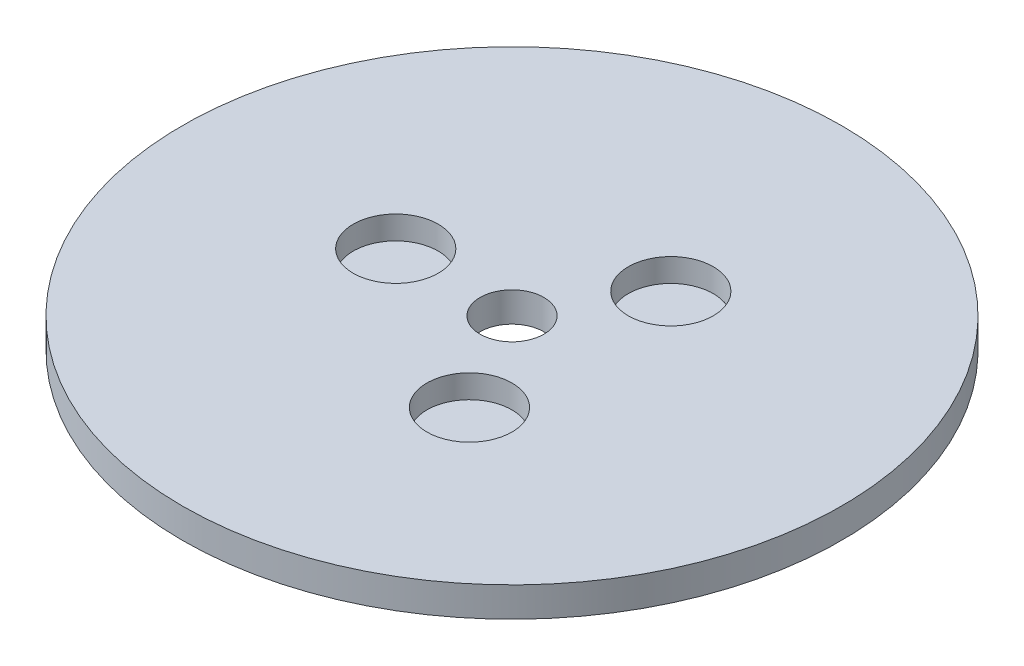
ISO-10303-21;
HEADER;
FILE_DESCRIPTION(('STEP AP214'),'2;1');
FILE_NAME('part.step','',(''),(''),'','','');
FILE_SCHEMA(('AUTOMOTIVE_DESIGN { 1 0 10303 214 1 1 1 1 }'));
ENDSEC;
DATA;
#1=APPLICATION_CONTEXT('core data for automotive mechanical design processes');
#2=APPLICATION_PROTOCOL_DEFINITION('international standard','automotive_design',2000,#1);
#3=PRODUCT_CONTEXT('',#1,'mechanical');
#4=PRODUCT('Part','Part','',(#3));
#5=PRODUCT_RELATED_PRODUCT_CATEGORY('part','',(#4));
#6=PRODUCT_DEFINITION_FORMATION('','',#4);
#7=PRODUCT_DEFINITION_CONTEXT('part definition',#1,'design');
#8=PRODUCT_DEFINITION('design','',#6,#7);
#9=PRODUCT_DEFINITION_SHAPE('','',#8);
#10=(LENGTH_UNIT() NAMED_UNIT(*) SI_UNIT(.MILLI.,.METRE.));
#11=(NAMED_UNIT(*) PLANE_ANGLE_UNIT() SI_UNIT($,.RADIAN.));
#12=(NAMED_UNIT(*) SI_UNIT($,.STERADIAN.) SOLID_ANGLE_UNIT());
#13=UNCERTAINTY_MEASURE_WITH_UNIT(LENGTH_MEASURE(1.E-05),#10,'distance_accuracy_value','');
#14=(GEOMETRIC_REPRESENTATION_CONTEXT(3) GLOBAL_UNCERTAINTY_ASSIGNED_CONTEXT((#13)) GLOBAL_UNIT_ASSIGNED_CONTEXT((#10,
#11,#12)) REPRESENTATION_CONTEXT('',''));
#15=CARTESIAN_POINT('',(0.,0.,0.));
#16=DIRECTION('',(0.,0.,1.));
#17=DIRECTION('',(1.,0.,0.));
#18=AXIS2_PLACEMENT_3D('',#15,#16,#17);
#19=CARTESIAN_POINT('',(0.,7.,0.));
#20=DIRECTION('',(0.,-1.,0.));
#21=DIRECTION('',(0.,0.,-1.));
#22=AXIS2_PLACEMENT_3D('',#19,#20,#21);
#23=CYLINDRICAL_SURFACE('',#22,77.5);
#24=CARTESIAN_POINT('',(0.,7.,0.));
#25=DIRECTION('',(0.,1.,0.));
#26=DIRECTION('',(0.,0.,1.));
#27=AXIS2_PLACEMENT_3D('',#24,#25,#26);
#28=CIRCLE('',#27,77.5);
#29=CARTESIAN_POINT('',(0.,7.,77.5));
#30=VERTEX_POINT('',#29);
#31=EDGE_CURVE('E10',#30,#30,#28,.T.);
#32=ORIENTED_EDGE('',*,*,#31,.F.);
#33=EDGE_LOOP('',(#32));
#34=FACE_BOUND('',#33,.T.);
#35=CARTESIAN_POINT('',(0.,0.,0.));
#36=DIRECTION('',(0.,1.,0.));
#37=DIRECTION('',(0.,0.,1.));
#38=AXIS2_PLACEMENT_3D('',#35,#36,#37);
#39=CIRCLE('',#38,77.5);
#40=CARTESIAN_POINT('',(0.,0.,77.5));
#41=VERTEX_POINT('',#40);
#42=EDGE_CURVE('E37',#41,#41,#39,.T.);
#43=ORIENTED_EDGE('',*,*,#42,.T.);
#44=EDGE_LOOP('',(#43));
#45=FACE_BOUND('',#44,.T.);
#46=ADVANCED_FACE('F40',(#34,#45),#23,.T.);
#47=CARTESIAN_POINT('',(0.,7.,0.));
#48=DIRECTION('',(0.,1.,0.));
#49=DIRECTION('',(0.,0.,1.));
#50=AXIS2_PLACEMENT_3D('',#47,#48,#49);
#51=PLANE('',#50);
#52=CARTESIAN_POINT('',(13.669895952939,7.,23.6769543246702));
#53=DIRECTION('',(0.,1.,0.));
#54=DIRECTION('',(0.866025403784436,0.,-0.500000000000004));
#55=AXIS2_PLACEMENT_3D('',#52,#53,#54);
#56=CIRCLE('',#55,10.);
#57=CARTESIAN_POINT('',(22.3301499907833,7.,18.6769543246702));
#58=VERTEX_POINT('',#57);
#59=EDGE_CURVE('E70',#58,#58,#56,.T.);
#60=ORIENTED_EDGE('',*,*,#59,.F.);
#61=EDGE_LOOP('',(#60));
#62=FACE_BOUND('',#61,.T.);
#63=CARTESIAN_POINT('',(13.6698959529386,7.,-23.6769543246704));
#64=DIRECTION('',(0.,1.,0.));
#65=DIRECTION('',(-0.866025403784443,0.,-0.499999999999992));
#66=AXIS2_PLACEMENT_3D('',#63,#64,#65);
#67=CIRCLE('',#66,10.);
#68=CARTESIAN_POINT('',(5.00964191509421,7.,-28.6769543246703));
#69=VERTEX_POINT('',#68);
#70=EDGE_CURVE('E61',#69,#69,#67,.T.);
#71=ORIENTED_EDGE('',*,*,#70,.F.);
#72=EDGE_LOOP('',(#71));
#73=FACE_BOUND('',#72,.T.);
#74=CARTESIAN_POINT('',(-27.3397919058777,7.,0.));
#75=DIRECTION('',(0.,1.,0.));
#76=DIRECTION('',(0.,0.,1.));
#77=AXIS2_PLACEMENT_3D('',#74,#75,#76);
#78=CIRCLE('',#77,10.);
#79=CARTESIAN_POINT('',(-27.3397919058777,7.,10.));
#80=VERTEX_POINT('',#79);
#81=EDGE_CURVE('E54',#80,#80,#78,.T.);
#82=ORIENTED_EDGE('',*,*,#81,.F.);
#83=EDGE_LOOP('',(#82));
#84=FACE_BOUND('',#83,.T.);
#85=CARTESIAN_POINT('',(0.,7.,0.));
#86=DIRECTION('',(0.,1.,0.));
#87=DIRECTION('',(0.,0.,1.));
#88=AXIS2_PLACEMENT_3D('',#85,#86,#87);
#89=CIRCLE('',#88,7.5);
#90=CARTESIAN_POINT('',(0.,7.,7.5));
#91=VERTEX_POINT('',#90);
#92=EDGE_CURVE('E50',#91,#91,#89,.T.);
#93=ORIENTED_EDGE('',*,*,#92,.F.);
#94=EDGE_LOOP('',(#93));
#95=FACE_BOUND('',#94,.T.);
#96=ORIENTED_EDGE('',*,*,#31,.T.);
#97=EDGE_LOOP('',(#96));
#98=FACE_BOUND('',#97,.T.);
#99=ADVANCED_FACE('F85',(#62,#73,#84,#95,#98),#51,.T.);
#100=CARTESIAN_POINT('',(0.,0.,0.));
#101=DIRECTION('',(0.,1.,0.));
#102=DIRECTION('',(0.,0.,1.));
#103=AXIS2_PLACEMENT_3D('',#100,#101,#102);
#104=PLANE('',#103);
#105=CARTESIAN_POINT('',(0.,0.,0.));
#106=DIRECTION('',(0.,1.,0.));
#107=DIRECTION('',(0.,0.,1.));
#108=AXIS2_PLACEMENT_3D('',#105,#106,#107);
#109=CIRCLE('',#108,7.5);
#110=CARTESIAN_POINT('',(0.,0.,7.5));
#111=VERTEX_POINT('',#110);
#112=EDGE_CURVE('E47',#111,#111,#109,.T.);
#113=ORIENTED_EDGE('',*,*,#112,.T.);
#114=EDGE_LOOP('',(#113));
#115=FACE_BOUND('',#114,.T.);
#116=ORIENTED_EDGE('',*,*,#42,.F.);
#117=EDGE_LOOP('',(#116));
#118=FACE_BOUND('',#117,.T.);
#119=ADVANCED_FACE('F84',(#115,#118),#104,.F.);
#120=CARTESIAN_POINT('',(0.,7.,0.));
#121=DIRECTION('',(0.,-1.,0.));
#122=DIRECTION('',(0.,0.,-1.));
#123=AXIS2_PLACEMENT_3D('',#120,#121,#122);
#124=CYLINDRICAL_SURFACE('',#123,7.5);
#125=ORIENTED_EDGE('',*,*,#92,.T.);
#126=EDGE_LOOP('',(#125));
#127=FACE_BOUND('',#126,.T.);
#128=ORIENTED_EDGE('',*,*,#112,.F.);
#129=EDGE_LOOP('',(#128));
#130=FACE_BOUND('',#129,.T.);
#131=ADVANCED_FACE('F91',(#127,#130),#124,.F.);
#132=CARTESIAN_POINT('',(-27.3397919058777,1.51740615883937,0.));
#133=DIRECTION('',(0.,1.,0.));
#134=DIRECTION('',(0.,0.,1.));
#135=AXIS2_PLACEMENT_3D('',#132,#133,#134);
#136=CYLINDRICAL_SURFACE('',#135,10.);
#137=CARTESIAN_POINT('',(-27.3397919058777,1.51740615883937,0.));
#138=DIRECTION('',(0.,1.,0.));
#139=DIRECTION('',(0.,0.,1.));
#140=AXIS2_PLACEMENT_3D('',#137,#138,#139);
#141=CIRCLE('',#140,10.);
#142=CARTESIAN_POINT('',(-27.3397919058777,1.51740615883937,10.));
#143=VERTEX_POINT('',#142);
#144=EDGE_CURVE('E55',#143,#143,#141,.T.);
#145=ORIENTED_EDGE('',*,*,#144,.F.);
#146=EDGE_LOOP('',(#145));
#147=FACE_BOUND('',#146,.T.);
#148=ORIENTED_EDGE('',*,*,#81,.T.);
#149=EDGE_LOOP('',(#148));
#150=FACE_BOUND('',#149,.T.);
#151=ADVANCED_FACE('F96',(#147,#150),#136,.F.);
#152=CARTESIAN_POINT('',(-27.3397919058777,1.51740615883937,0.));
#153=DIRECTION('',(0.,1.,0.));
#154=DIRECTION('',(0.,0.,1.));
#155=AXIS2_PLACEMENT_3D('',#152,#153,#154);
#156=PLANE('',#155);
#157=ORIENTED_EDGE('',*,*,#144,.T.);
#158=EDGE_LOOP('',(#157));
#159=FACE_BOUND('',#158,.T.);
#160=ADVANCED_FACE('F127',(#159),#156,.T.);
#161=CARTESIAN_POINT('',(13.6698959529386,1.51740615883937,-23.6769543246704));
#162=DIRECTION('',(0.,1.,0.));
#163=DIRECTION('',(0.,0.,1.));
#164=AXIS2_PLACEMENT_3D('',#161,#162,#163);
#165=CYLINDRICAL_SURFACE('',#164,10.);
#166=CARTESIAN_POINT('',(13.6698959529386,1.51740615883937,-23.6769543246704));
#167=DIRECTION('',(0.,1.,0.));
#168=DIRECTION('',(-0.866025403784443,0.,-0.499999999999992));
#169=AXIS2_PLACEMENT_3D('',#166,#167,#168);
#170=CIRCLE('',#169,10.);
#171=CARTESIAN_POINT('',(5.00964191509421,1.51740615883937,-28.6769543246703));
#172=VERTEX_POINT('',#171);
#173=EDGE_CURVE('E63',#172,#172,#170,.T.);
#174=ORIENTED_EDGE('',*,*,#173,.F.);
#175=EDGE_LOOP('',(#174));
#176=FACE_BOUND('',#175,.T.);
#177=ORIENTED_EDGE('',*,*,#70,.T.);
#178=EDGE_LOOP('',(#177));
#179=FACE_BOUND('',#178,.T.);
#180=ADVANCED_FACE('F133',(#176,#179),#165,.F.);
#181=CARTESIAN_POINT('',(13.6698959529386,1.51740615883937,-23.6769543246704));
#182=DIRECTION('',(0.,1.,0.));
#183=DIRECTION('',(-0.866025403784443,0.,-0.499999999999992));
#184=AXIS2_PLACEMENT_3D('',#181,#182,#183);
#185=PLANE('',#184);
#186=ORIENTED_EDGE('',*,*,#173,.T.);
#187=EDGE_LOOP('',(#186));
#188=FACE_BOUND('',#187,.T.);
#189=ADVANCED_FACE('F77',(#188),#185,.T.);
#190=CARTESIAN_POINT('',(13.669895952939,1.51740615883937,23.6769543246702));
#191=DIRECTION('',(0.,1.,0.));
#192=DIRECTION('',(0.,0.,1.));
#193=AXIS2_PLACEMENT_3D('',#190,#191,#192);
#194=CYLINDRICAL_SURFACE('',#193,10.);
#195=CARTESIAN_POINT('',(13.669895952939,1.51740615883937,23.6769543246702));
#196=DIRECTION('',(0.,1.,0.));
#197=DIRECTION('',(0.866025403784436,0.,-0.500000000000004));
#198=AXIS2_PLACEMENT_3D('',#195,#196,#197);
#199=CIRCLE('',#198,10.);
#200=CARTESIAN_POINT('',(22.3301499907833,1.51740615883937,18.6769543246702));
#201=VERTEX_POINT('',#200);
#202=EDGE_CURVE('E59',#201,#201,#199,.T.);
#203=ORIENTED_EDGE('',*,*,#202,.F.);
#204=EDGE_LOOP('',(#203));
#205=FACE_BOUND('',#204,.T.);
#206=ORIENTED_EDGE('',*,*,#59,.T.);
#207=EDGE_LOOP('',(#206));
#208=FACE_BOUND('',#207,.T.);
#209=ADVANCED_FACE('F73',(#205,#208),#194,.F.);
#210=CARTESIAN_POINT('',(13.669895952939,1.51740615883937,23.6769543246702));
#211=DIRECTION('',(0.,1.,0.));
#212=DIRECTION('',(0.866025403784436,0.,-0.500000000000004));
#213=AXIS2_PLACEMENT_3D('',#210,#211,#212);
#214=PLANE('',#213);
#215=ORIENTED_EDGE('',*,*,#202,.T.);
#216=EDGE_LOOP('',(#215));
#217=FACE_BOUND('',#216,.T.);
#218=ADVANCED_FACE('F71',(#217),#214,.T.);
#219=CLOSED_SHELL('',(#46,#99,#119,#131,#151,#160,#180,#189,#209,#218));
#220=MANIFOLD_SOLID_BREP('B2',#219);
#221=ADVANCED_BREP_SHAPE_REPRESENTATION('',(#18,#220),#14);
#222=SHAPE_DEFINITION_REPRESENTATION(#9,#221);
ENDSEC;
END-ISO-10303-21;
